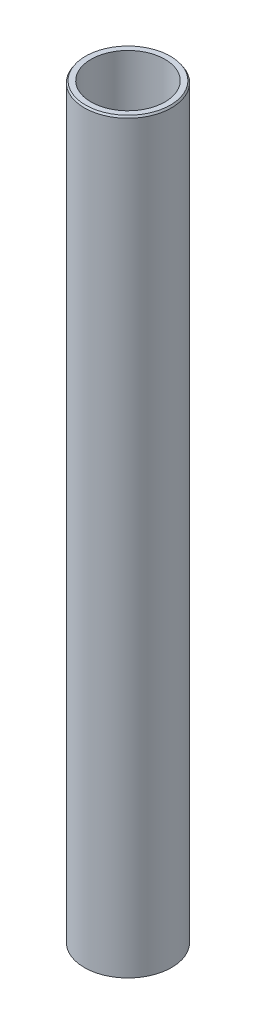
ISO-10303-21;
HEADER;
FILE_DESCRIPTION(('STEP AP214'),'2;1');
FILE_NAME('part.step','',(''),(''),'','','');
FILE_SCHEMA(('AUTOMOTIVE_DESIGN { 1 0 10303 214 1 1 1 1 }'));
ENDSEC;
DATA;
#1=APPLICATION_CONTEXT('core data for automotive mechanical design processes');
#2=APPLICATION_PROTOCOL_DEFINITION('international standard','automotive_design',2000,#1);
#3=PRODUCT_CONTEXT('',#1,'mechanical');
#4=PRODUCT('Part','Part','',(#3));
#5=PRODUCT_RELATED_PRODUCT_CATEGORY('part','',(#4));
#6=PRODUCT_DEFINITION_FORMATION('','',#4);
#7=PRODUCT_DEFINITION_CONTEXT('part definition',#1,'design');
#8=PRODUCT_DEFINITION('design','',#6,#7);
#9=PRODUCT_DEFINITION_SHAPE('','',#8);
#10=(LENGTH_UNIT() NAMED_UNIT(*) SI_UNIT(.MILLI.,.METRE.));
#11=(NAMED_UNIT(*) PLANE_ANGLE_UNIT() SI_UNIT($,.RADIAN.));
#12=(NAMED_UNIT(*) SI_UNIT($,.STERADIAN.) SOLID_ANGLE_UNIT());
#13=UNCERTAINTY_MEASURE_WITH_UNIT(LENGTH_MEASURE(1.E-05),#10,'distance_accuracy_value','');
#14=(GEOMETRIC_REPRESENTATION_CONTEXT(3) GLOBAL_UNCERTAINTY_ASSIGNED_CONTEXT((#13)) GLOBAL_UNIT_ASSIGNED_CONTEXT((#10,
#11,#12)) REPRESENTATION_CONTEXT('',''));
#15=CARTESIAN_POINT('',(0.,0.,0.));
#16=DIRECTION('',(0.,0.,1.));
#17=DIRECTION('',(1.,0.,0.));
#18=AXIS2_PLACEMENT_3D('',#15,#16,#17);
#19=CARTESIAN_POINT('',(0.,600.,0.));
#20=DIRECTION('',(0.,-1.,0.));
#21=DIRECTION('',(0.,0.,-1.));
#22=AXIS2_PLACEMENT_3D('',#19,#20,#21);
#23=CYLINDRICAL_SURFACE('',#22,35.);
#24=CARTESIAN_POINT('',(0.,598.566026018605,0.));
#25=DIRECTION('',(0.,1.,0.));
#26=DIRECTION('',(0.,0.,1.));
#27=AXIS2_PLACEMENT_3D('',#24,#25,#26);
#28=CIRCLE('',#27,35.);
#29=CARTESIAN_POINT('',(0.,598.566026018605,35.));
#30=VERTEX_POINT('',#29);
#31=EDGE_CURVE('E50',#30,#30,#28,.F.);
#32=ORIENTED_EDGE('',*,*,#31,.T.);
#33=EDGE_LOOP('',(#32));
#34=FACE_BOUND('',#33,.T.);
#35=CARTESIAN_POINT('',(0.,0.969616982193555,0.));
#36=DIRECTION('',(0.,1.,0.));
#37=DIRECTION('',(0.,0.,1.));
#38=AXIS2_PLACEMENT_3D('',#35,#36,#37);
#39=CIRCLE('',#38,35.);
#40=CARTESIAN_POINT('',(0.,0.969616982193555,35.));
#41=VERTEX_POINT('',#40);
#42=EDGE_CURVE('E51',#41,#41,#39,.T.);
#43=ORIENTED_EDGE('',*,*,#42,.T.);
#44=EDGE_LOOP('',(#43));
#45=FACE_BOUND('',#44,.T.);
#46=ADVANCED_FACE('F39',(#34,#45),#23,.T.);
#47=CARTESIAN_POINT('',(0.,600.,0.));
#48=DIRECTION('',(0.,1.,0.));
#49=DIRECTION('',(0.,0.,1.));
#50=AXIS2_PLACEMENT_3D('',#47,#48,#49);
#51=PLANE('',#50);
#52=CARTESIAN_POINT('',(0.,600.,0.));
#53=DIRECTION('',(0.,1.,0.));
#54=DIRECTION('',(0.,0.,1.));
#55=AXIS2_PLACEMENT_3D('',#52,#53,#54);
#56=CIRCLE('',#55,34.0303830178062);
#57=CARTESIAN_POINT('',(0.,600.,34.0303830178062));
#58=VERTEX_POINT('',#57);
#59=EDGE_CURVE('E54',#58,#58,#56,.T.);
#60=ORIENTED_EDGE('',*,*,#59,.T.);
#61=EDGE_LOOP('',(#60));
#62=FACE_BOUND('',#61,.T.);
#63=CARTESIAN_POINT('',(0.,600.,0.));
#64=DIRECTION('',(0.,1.,0.));
#65=DIRECTION('',(0.,0.,1.));
#66=AXIS2_PLACEMENT_3D('',#63,#64,#65);
#67=CIRCLE('',#66,29.6849890020346);
#68=CARTESIAN_POINT('',(0.,600.,29.6849890020346));
#69=VERTEX_POINT('',#68);
#70=EDGE_CURVE('E58',#69,#69,#67,.T.);
#71=ORIENTED_EDGE('',*,*,#70,.F.);
#72=EDGE_LOOP('',(#71));
#73=FACE_BOUND('',#72,.T.);
#74=ADVANCED_FACE('F69',(#62,#73),#51,.T.);
#75=CARTESIAN_POINT('',(0.,0.,0.));
#76=DIRECTION('',(0.,1.,0.));
#77=DIRECTION('',(0.,0.,1.));
#78=AXIS2_PLACEMENT_3D('',#75,#76,#77);
#79=PLANE('',#78);
#80=CARTESIAN_POINT('',(0.,0.,0.));
#81=DIRECTION('',(0.,1.,0.));
#82=DIRECTION('',(0.,0.,1.));
#83=AXIS2_PLACEMENT_3D('',#80,#81,#82);
#84=CIRCLE('',#83,33.5660260186054);
#85=CARTESIAN_POINT('',(0.,0.,33.5660260186054));
#86=VERTEX_POINT('',#85);
#87=EDGE_CURVE('E10',#86,#86,#84,.F.);
#88=ORIENTED_EDGE('',*,*,#87,.T.);
#89=EDGE_LOOP('',(#88));
#90=FACE_BOUND('',#89,.T.);
#91=CARTESIAN_POINT('',(0.,0.,0.));
#92=DIRECTION('',(0.,1.,0.));
#93=DIRECTION('',(0.,0.,1.));
#94=AXIS2_PLACEMENT_3D('',#91,#92,#93);
#95=CIRCLE('',#94,29.6849890020346);
#96=CARTESIAN_POINT('',(0.,0.,29.6849890020346));
#97=VERTEX_POINT('',#96);
#98=EDGE_CURVE('E63',#97,#97,#95,.T.);
#99=ORIENTED_EDGE('',*,*,#98,.T.);
#100=EDGE_LOOP('',(#99));
#101=FACE_BOUND('',#100,.T.);
#102=ADVANCED_FACE('F75',(#90,#101),#79,.F.);
#103=CARTESIAN_POINT('',(0.,600.,0.));
#104=DIRECTION('',(0.,-1.,0.));
#105=DIRECTION('',(0.,0.,-1.));
#106=AXIS2_PLACEMENT_3D('',#103,#104,#105);
#107=CYLINDRICAL_SURFACE('',#106,29.6849890020346);
#108=ORIENTED_EDGE('',*,*,#70,.T.);
#109=EDGE_LOOP('',(#108));
#110=FACE_BOUND('',#109,.T.);
#111=ORIENTED_EDGE('',*,*,#98,.F.);
#112=EDGE_LOOP('',(#111));
#113=FACE_BOUND('',#112,.T.);
#114=ADVANCED_FACE('F70',(#110,#113),#107,.F.);
#115=CARTESIAN_POINT('',(0.,600.,0.));
#116=DIRECTION('',(0.,-1.,0.));
#117=DIRECTION('',(0.,0.,-1.));
#118=AXIS2_PLACEMENT_3D('',#115,#116,#117);
#119=CONICAL_SURFACE('',#118,34.0303830178062,0.594556261041303);
#120=ORIENTED_EDGE('',*,*,#31,.F.);
#121=EDGE_LOOP('',(#120));
#122=FACE_BOUND('',#121,.T.);
#123=ORIENTED_EDGE('',*,*,#59,.F.);
#124=EDGE_LOOP('',(#123));
#125=FACE_BOUND('',#124,.T.);
#126=ADVANCED_FACE('F81',(#122,#125),#119,.T.);
#127=CARTESIAN_POINT('',(0.,0.969616982193555,0.));
#128=DIRECTION('',(0.,1.,0.));
#129=DIRECTION('',(0.,0.,1.));
#130=AXIS2_PLACEMENT_3D('',#127,#128,#129);
#131=CONICAL_SURFACE('',#130,35.,0.976240065753638);
#132=ORIENTED_EDGE('',*,*,#87,.F.);
#133=EDGE_LOOP('',(#132));
#134=FACE_BOUND('',#133,.T.);
#135=ORIENTED_EDGE('',*,*,#42,.F.);
#136=EDGE_LOOP('',(#135));
#137=FACE_BOUND('',#136,.T.);
#138=ADVANCED_FACE('F45',(#134,#137),#131,.T.);
#139=CLOSED_SHELL('',(#46,#74,#102,#114,#126,#138));
#140=MANIFOLD_SOLID_BREP('B2',#139);
#141=ADVANCED_BREP_SHAPE_REPRESENTATION('',(#18,#140),#14);
#142=SHAPE_DEFINITION_REPRESENTATION(#9,#141);
ENDSEC;
END-ISO-10303-21;
